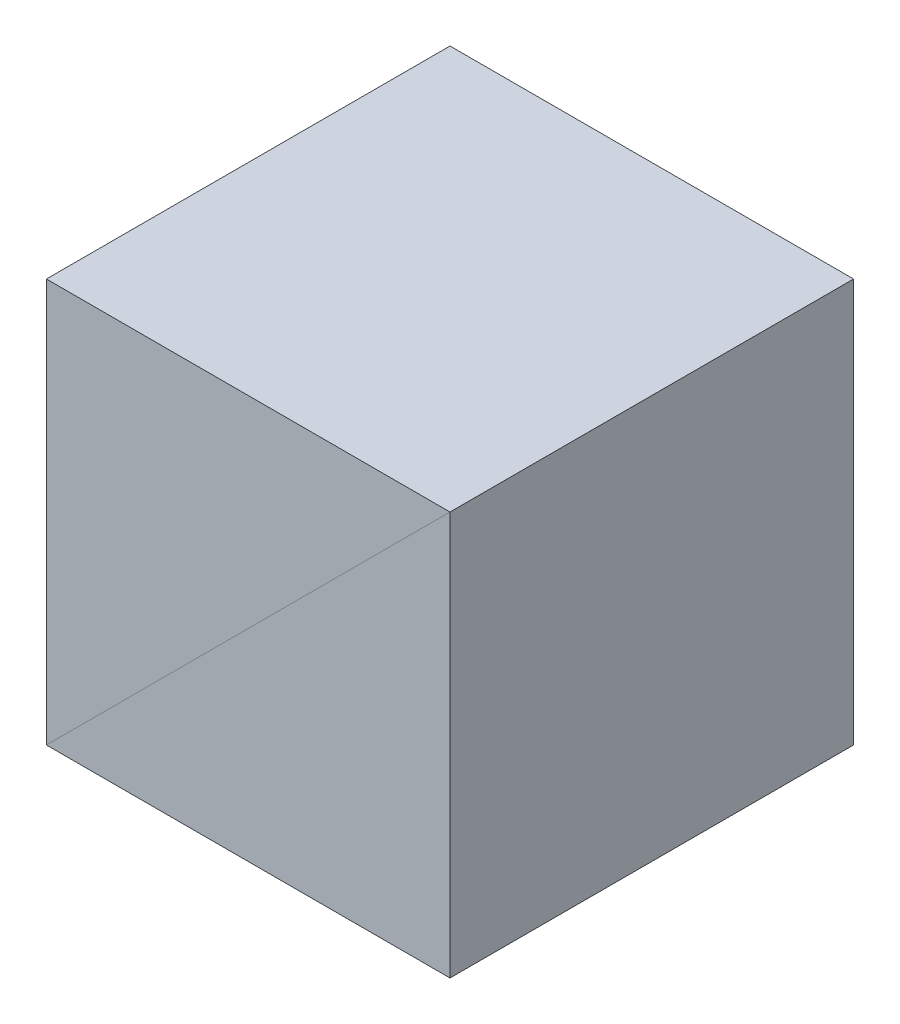
ISO-10303-21;
HEADER;
FILE_DESCRIPTION(('STEP AP214'),'2;1');
FILE_NAME('part.step','',(''),(''),'','','');
FILE_SCHEMA(('AUTOMOTIVE_DESIGN { 1 0 10303 214 1 1 1 1 }'));
ENDSEC;
DATA;
#1=APPLICATION_CONTEXT('core data for automotive mechanical design processes');
#2=APPLICATION_PROTOCOL_DEFINITION('international standard','automotive_design',2000,#1);
#3=PRODUCT_CONTEXT('',#1,'mechanical');
#4=PRODUCT('Part','Part','',(#3));
#5=PRODUCT_RELATED_PRODUCT_CATEGORY('part','',(#4));
#6=PRODUCT_DEFINITION_FORMATION('','',#4);
#7=PRODUCT_DEFINITION_CONTEXT('part definition',#1,'design');
#8=PRODUCT_DEFINITION('design','',#6,#7);
#9=PRODUCT_DEFINITION_SHAPE('','',#8);
#10=(LENGTH_UNIT() NAMED_UNIT(*) SI_UNIT(.MILLI.,.METRE.));
#11=(NAMED_UNIT(*) PLANE_ANGLE_UNIT() SI_UNIT($,.RADIAN.));
#12=(NAMED_UNIT(*) SI_UNIT($,.STERADIAN.) SOLID_ANGLE_UNIT());
#13=UNCERTAINTY_MEASURE_WITH_UNIT(LENGTH_MEASURE(1.E-05),#10,'distance_accuracy_value','');
#14=(GEOMETRIC_REPRESENTATION_CONTEXT(3) GLOBAL_UNCERTAINTY_ASSIGNED_CONTEXT((#13)) GLOBAL_UNIT_ASSIGNED_CONTEXT((#10,
#11,#12)) REPRESENTATION_CONTEXT('',''));
#15=CARTESIAN_POINT('',(0.,0.,0.));
#16=DIRECTION('',(0.,0.,1.));
#17=DIRECTION('',(1.,0.,0.));
#18=AXIS2_PLACEMENT_3D('',#15,#16,#17);
#19=CARTESIAN_POINT('',(2.5,2.5,2.5));
#20=DIRECTION('',(-0.707106781186548,0.707106781186548,0.));
#21=DIRECTION('',(0.707106781186548,0.707106781186547,0.));
#22=AXIS2_PLACEMENT_3D('',#19,#20,#21);
#23=PLANE('',#22);
#24=DIRECTION('',(-0.707106781186548,-0.707106781186547,0.));
#25=VECTOR('',#24,1.);
#26=CARTESIAN_POINT('',(2.5,2.5,-2.5));
#27=LINE('',#26,#25);
#28=CARTESIAN_POINT('',(2.5,2.5,-2.5));
#29=VERTEX_POINT('',#28);
#30=CARTESIAN_POINT('',(-2.5,-2.5,-2.5));
#31=VERTEX_POINT('',#30);
#32=EDGE_CURVE('E101',#29,#31,#27,.T.);
#33=ORIENTED_EDGE('',*,*,#32,.F.);
#34=DIRECTION('',(0.,0.,-1.));
#35=VECTOR('',#34,1.);
#36=CARTESIAN_POINT('',(2.5,2.5,2.5));
#37=LINE('',#36,#35);
#38=CARTESIAN_POINT('',(2.5,2.5,2.5));
#39=VERTEX_POINT('',#38);
#40=EDGE_CURVE('E96',#39,#29,#37,.T.);
#41=ORIENTED_EDGE('',*,*,#40,.F.);
#42=DIRECTION('',(-0.707106781186548,-0.707106781186547,0.));
#43=VECTOR('',#42,1.);
#44=CARTESIAN_POINT('',(2.5,2.5,2.5));
#45=LINE('',#44,#43);
#46=CARTESIAN_POINT('',(-2.5,-2.5,2.5));
#47=VERTEX_POINT('',#46);
#48=EDGE_CURVE('E88',#39,#47,#45,.T.);
#49=ORIENTED_EDGE('',*,*,#48,.T.);
#50=DIRECTION('',(0.,0.,-1.));
#51=VECTOR('',#50,1.);
#52=CARTESIAN_POINT('',(-2.5,-2.5,2.5));
#53=LINE('',#52,#51);
#54=EDGE_CURVE('E12',#47,#31,#53,.T.);
#55=ORIENTED_EDGE('',*,*,#54,.T.);
#56=EDGE_LOOP('',(#33,#41,#49,#55));
#57=FACE_BOUND('',#56,.T.);
#58=ADVANCED_FACE('F49',(#57),#23,.F.);
#59=CARTESIAN_POINT('',(-2.5,-2.5,2.5));
#60=DIRECTION('',(1.,0.,0.));
#61=DIRECTION('',(0.,0.,1.));
#62=AXIS2_PLACEMENT_3D('',#59,#60,#61);
#63=PLANE('',#62);
#64=DIRECTION('',(0.,1.,0.));
#65=VECTOR('',#64,1.);
#66=CARTESIAN_POINT('',(-2.5,-2.5,-2.5));
#67=LINE('',#66,#65);
#68=CARTESIAN_POINT('',(-2.5,2.5,-2.5));
#69=VERTEX_POINT('',#68);
#70=EDGE_CURVE('E93',#31,#69,#67,.T.);
#71=ORIENTED_EDGE('',*,*,#70,.F.);
#72=ORIENTED_EDGE('',*,*,#54,.F.);
#73=DIRECTION('',(0.,1.,0.));
#74=VECTOR('',#73,1.);
#75=CARTESIAN_POINT('',(-2.5,-2.5,2.5));
#76=LINE('',#75,#74);
#77=CARTESIAN_POINT('',(-2.5,2.5,2.5));
#78=VERTEX_POINT('',#77);
#79=EDGE_CURVE('E84',#47,#78,#76,.T.);
#80=ORIENTED_EDGE('',*,*,#79,.T.);
#81=DIRECTION('',(0.,0.,-1.));
#82=VECTOR('',#81,1.);
#83=CARTESIAN_POINT('',(-2.5,2.5,2.5));
#84=LINE('',#83,#82);
#85=EDGE_CURVE('E57',#78,#69,#84,.T.);
#86=ORIENTED_EDGE('',*,*,#85,.T.);
#87=EDGE_LOOP('',(#71,#72,#80,#86));
#88=FACE_BOUND('',#87,.T.);
#89=ADVANCED_FACE('F92',(#88),#63,.F.);
#90=CARTESIAN_POINT('',(2.5,2.5,2.5));
#91=DIRECTION('',(0.,-1.,0.));
#92=DIRECTION('',(-1.,0.,0.));
#93=AXIS2_PLACEMENT_3D('',#90,#91,#92);
#94=PLANE('',#93);
#95=DIRECTION('',(1.,0.,0.));
#96=VECTOR('',#95,1.);
#97=CARTESIAN_POINT('',(2.5,2.5,-2.5));
#98=LINE('',#97,#96);
#99=EDGE_CURVE('E76',#69,#29,#98,.T.);
#100=ORIENTED_EDGE('',*,*,#99,.F.);
#101=ORIENTED_EDGE('',*,*,#85,.F.);
#102=DIRECTION('',(1.,0.,0.));
#103=VECTOR('',#102,1.);
#104=CARTESIAN_POINT('',(2.5,2.5,2.5));
#105=LINE('',#104,#103);
#106=EDGE_CURVE('E65',#78,#39,#105,.T.);
#107=ORIENTED_EDGE('',*,*,#106,.T.);
#108=ORIENTED_EDGE('',*,*,#40,.T.);
#109=EDGE_LOOP('',(#100,#101,#107,#108));
#110=FACE_BOUND('',#109,.T.);
#111=ADVANCED_FACE('F110',(#110),#94,.F.);
#112=CARTESIAN_POINT('',(0.,0.,2.5));
#113=DIRECTION('',(0.,0.,1.));
#114=DIRECTION('',(0.,1.,0.));
#115=AXIS2_PLACEMENT_3D('',#112,#113,#114);
#116=PLANE('',#115);
#117=ORIENTED_EDGE('',*,*,#48,.F.);
#118=ORIENTED_EDGE('',*,*,#106,.F.);
#119=ORIENTED_EDGE('',*,*,#79,.F.);
#120=EDGE_LOOP('',(#117,#118,#119));
#121=FACE_BOUND('',#120,.T.);
#122=ADVANCED_FACE('F86',(#121),#116,.T.);
#123=CARTESIAN_POINT('',(0.,0.,-2.5));
#124=DIRECTION('',(0.,0.,1.));
#125=DIRECTION('',(0.,1.,0.));
#126=AXIS2_PLACEMENT_3D('',#123,#124,#125);
#127=PLANE('',#126);
#128=ORIENTED_EDGE('',*,*,#32,.T.);
#129=ORIENTED_EDGE('',*,*,#70,.T.);
#130=ORIENTED_EDGE('',*,*,#99,.T.);
#131=EDGE_LOOP('',(#128,#129,#130));
#132=FACE_BOUND('',#131,.T.);
#133=ADVANCED_FACE('F104',(#132),#127,.F.);
#134=CLOSED_SHELL('',(#58,#89,#111,#122,#133));
#135=MANIFOLD_SOLID_BREP('B2',#134);
#136=CARTESIAN_POINT('',(2.5,2.5,2.5));
#137=DIRECTION('',(0.707106781186547,-0.707106781186548,0.));
#138=DIRECTION('',(0.707106781186548,0.707106781186547,0.));
#139=AXIS2_PLACEMENT_3D('',#136,#137,#138);
#140=PLANE('',#139);
#141=DIRECTION('',(-0.707106781186548,-0.707106781186547,0.));
#142=VECTOR('',#141,1.);
#143=CARTESIAN_POINT('',(2.5,2.5,-2.5));
#144=LINE('',#143,#142);
#145=CARTESIAN_POINT('',(2.5,2.5,-2.5));
#146=VERTEX_POINT('',#145);
#147=CARTESIAN_POINT('',(-2.5,-2.5,-2.5));
#148=VERTEX_POINT('',#147);
#149=EDGE_CURVE('E197',#146,#148,#144,.T.);
#150=ORIENTED_EDGE('',*,*,#149,.T.);
#151=DIRECTION('',(0.,0.,-1.));
#152=VECTOR('',#151,1.);
#153=CARTESIAN_POINT('',(-2.5,-2.5,2.5));
#154=LINE('',#153,#152);
#155=CARTESIAN_POINT('',(-2.5,-2.5,2.5));
#156=VERTEX_POINT('',#155);
#157=EDGE_CURVE('E47',#156,#148,#154,.T.);
#158=ORIENTED_EDGE('',*,*,#157,.F.);
#159=DIRECTION('',(-0.707106781186548,-0.707106781186547,0.));
#160=VECTOR('',#159,1.);
#161=CARTESIAN_POINT('',(2.5,2.5,2.5));
#162=LINE('',#161,#160);
#163=CARTESIAN_POINT('',(2.5,2.5,2.5));
#164=VERTEX_POINT('',#163);
#165=EDGE_CURVE('E189',#164,#156,#162,.T.);
#166=ORIENTED_EDGE('',*,*,#165,.F.);
#167=DIRECTION('',(0.,0.,-1.));
#168=VECTOR('',#167,1.);
#169=CARTESIAN_POINT('',(2.5,2.5,2.5));
#170=LINE('',#169,#168);
#171=EDGE_CURVE('E198',#164,#146,#170,.T.);
#172=ORIENTED_EDGE('',*,*,#171,.T.);
#173=EDGE_LOOP('',(#150,#158,#166,#172));
#174=FACE_BOUND('',#173,.T.);
#175=ADVANCED_FACE('F147',(#174),#140,.F.);
#176=CARTESIAN_POINT('',(-2.5,-2.5,2.5));
#177=DIRECTION('',(0.,1.,0.));
#178=DIRECTION('',(0.,0.,1.));
#179=AXIS2_PLACEMENT_3D('',#176,#177,#178);
#180=PLANE('',#179);
#181=DIRECTION('',(1.,0.,0.));
#182=VECTOR('',#181,1.);
#183=CARTESIAN_POINT('',(-2.5,-2.5,-2.5));
#184=LINE('',#183,#182);
#185=CARTESIAN_POINT('',(2.5,-2.5,-2.5));
#186=VERTEX_POINT('',#185);
#187=EDGE_CURVE('E176',#148,#186,#184,.T.);
#188=ORIENTED_EDGE('',*,*,#187,.T.);
#189=DIRECTION('',(0.,0.,-1.));
#190=VECTOR('',#189,1.);
#191=CARTESIAN_POINT('',(2.5,-2.5,2.5));
#192=LINE('',#191,#190);
#193=CARTESIAN_POINT('',(2.5,-2.5,2.5));
#194=VERTEX_POINT('',#193);
#195=EDGE_CURVE('E156',#194,#186,#192,.T.);
#196=ORIENTED_EDGE('',*,*,#195,.F.);
#197=DIRECTION('',(1.,0.,0.));
#198=VECTOR('',#197,1.);
#199=CARTESIAN_POINT('',(-2.5,-2.5,2.5));
#200=LINE('',#199,#198);
#201=EDGE_CURVE('E184',#156,#194,#200,.T.);
#202=ORIENTED_EDGE('',*,*,#201,.F.);
#203=ORIENTED_EDGE('',*,*,#157,.T.);
#204=EDGE_LOOP('',(#188,#196,#202,#203));
#205=FACE_BOUND('',#204,.T.);
#206=ADVANCED_FACE('F185',(#205),#180,.F.);
#207=CARTESIAN_POINT('',(2.5,2.5,2.5));
#208=DIRECTION('',(-1.,0.,0.));
#209=DIRECTION('',(0.,-1.,0.));
#210=AXIS2_PLACEMENT_3D('',#207,#208,#209);
#211=PLANE('',#210);
#212=DIRECTION('',(0.,1.,0.));
#213=VECTOR('',#212,1.);
#214=CARTESIAN_POINT('',(2.5,2.5,-2.5));
#215=LINE('',#214,#213);
#216=EDGE_CURVE('E181',#186,#146,#215,.T.);
#217=ORIENTED_EDGE('',*,*,#216,.T.);
#218=ORIENTED_EDGE('',*,*,#171,.F.);
#219=DIRECTION('',(0.,1.,0.));
#220=VECTOR('',#219,1.);
#221=CARTESIAN_POINT('',(2.5,2.5,2.5));
#222=LINE('',#221,#220);
#223=EDGE_CURVE('E164',#194,#164,#222,.T.);
#224=ORIENTED_EDGE('',*,*,#223,.F.);
#225=ORIENTED_EDGE('',*,*,#195,.T.);
#226=EDGE_LOOP('',(#217,#218,#224,#225));
#227=FACE_BOUND('',#226,.T.);
#228=ADVANCED_FACE('F210',(#227),#211,.F.);
#229=CARTESIAN_POINT('',(0.,0.,2.5));
#230=DIRECTION('',(0.,0.,1.));
#231=DIRECTION('',(1.,0.,0.));
#232=AXIS2_PLACEMENT_3D('',#229,#230,#231);
#233=PLANE('',#232);
#234=ORIENTED_EDGE('',*,*,#165,.T.);
#235=ORIENTED_EDGE('',*,*,#201,.T.);
#236=ORIENTED_EDGE('',*,*,#223,.T.);
#237=EDGE_LOOP('',(#234,#235,#236));
#238=FACE_BOUND('',#237,.T.);
#239=ADVANCED_FACE('F192',(#238),#233,.T.);
#240=CARTESIAN_POINT('',(0.,0.,-2.5));
#241=DIRECTION('',(0.,0.,1.));
#242=DIRECTION('',(1.,0.,0.));
#243=AXIS2_PLACEMENT_3D('',#240,#241,#242);
#244=PLANE('',#243);
#245=ORIENTED_EDGE('',*,*,#149,.F.);
#246=ORIENTED_EDGE('',*,*,#216,.F.);
#247=ORIENTED_EDGE('',*,*,#187,.F.);
#248=EDGE_LOOP('',(#245,#246,#247));
#249=FACE_BOUND('',#248,.T.);
#250=ADVANCED_FACE('F211',(#249),#244,.F.);
#251=CLOSED_SHELL('',(#175,#206,#228,#239,#250));
#252=MANIFOLD_SOLID_BREP('B6',#251);
#253=ADVANCED_BREP_SHAPE_REPRESENTATION('',(#18,#135,#252),#14);
#254=SHAPE_DEFINITION_REPRESENTATION(#9,#253);
ENDSEC;
END-ISO-10303-21;
